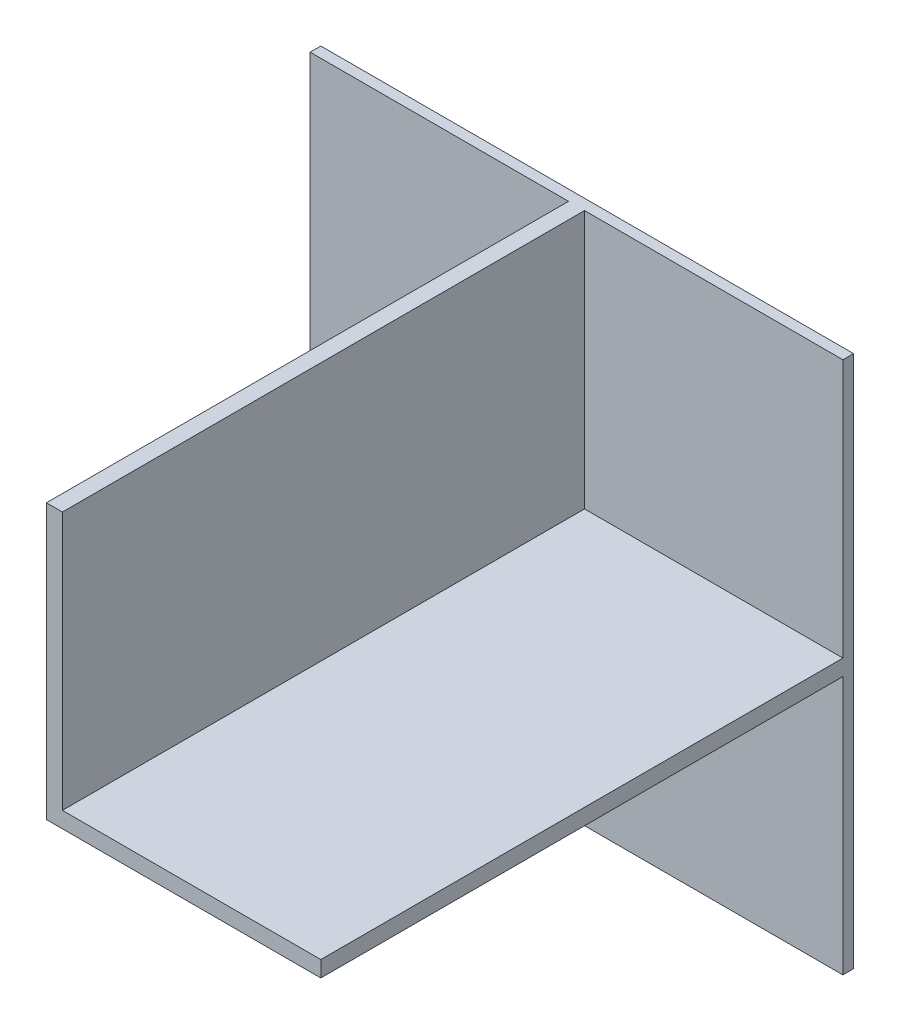
ISO-10303-21;
HEADER;
FILE_DESCRIPTION(('STEP AP214'),'2;1');
FILE_NAME('part.step','',(''),(''),'','','');
FILE_SCHEMA(('AUTOMOTIVE_DESIGN { 1 0 10303 214 1 1 1 1 }'));
ENDSEC;
DATA;
#1=APPLICATION_CONTEXT('core data for automotive mechanical design processes');
#2=APPLICATION_PROTOCOL_DEFINITION('international standard','automotive_design',2000,#1);
#3=PRODUCT_CONTEXT('',#1,'mechanical');
#4=PRODUCT('Part','Part','',(#3));
#5=PRODUCT_RELATED_PRODUCT_CATEGORY('part','',(#4));
#6=PRODUCT_DEFINITION_FORMATION('','',#4);
#7=PRODUCT_DEFINITION_CONTEXT('part definition',#1,'design');
#8=PRODUCT_DEFINITION('design','',#6,#7);
#9=PRODUCT_DEFINITION_SHAPE('','',#8);
#10=(LENGTH_UNIT() NAMED_UNIT(*) SI_UNIT(.MILLI.,.METRE.));
#11=(NAMED_UNIT(*) PLANE_ANGLE_UNIT() SI_UNIT($,.RADIAN.));
#12=(NAMED_UNIT(*) SI_UNIT($,.STERADIAN.) SOLID_ANGLE_UNIT());
#13=UNCERTAINTY_MEASURE_WITH_UNIT(LENGTH_MEASURE(1.E-05),#10,'distance_accuracy_value','');
#14=(GEOMETRIC_REPRESENTATION_CONTEXT(3) GLOBAL_UNCERTAINTY_ASSIGNED_CONTEXT((#13)) GLOBAL_UNIT_ASSIGNED_CONTEXT((#10,
#11,#12)) REPRESENTATION_CONTEXT('',''));
#15=CARTESIAN_POINT('',(0.,0.,0.));
#16=DIRECTION('',(0.,0.,1.));
#17=DIRECTION('',(1.,0.,0.));
#18=AXIS2_PLACEMENT_3D('',#15,#16,#17);
#19=CARTESIAN_POINT('',(0.,0.,4.));
#20=DIRECTION('',(0.,0.,1.));
#21=DIRECTION('',(1.,0.,0.));
#22=AXIS2_PLACEMENT_3D('',#19,#20,#21);
#23=PLANE('',#22);
#24=DIRECTION('',(-1.,0.,0.));
#25=VECTOR('',#24,1.);
#26=CARTESIAN_POINT('',(0.,-3.,4.));
#27=LINE('',#26,#25);
#28=CARTESIAN_POINT('',(100.,-3.,4.));
#29=VERTEX_POINT('',#28);
#30=CARTESIAN_POINT('',(-3.,-3.,4.));
#31=VERTEX_POINT('',#30);
#32=EDGE_CURVE('E168',#29,#31,#27,.T.);
#33=ORIENTED_EDGE('',*,*,#32,.T.);
#34=DIRECTION('',(0.,1.,0.));
#35=VECTOR('',#34,1.);
#36=CARTESIAN_POINT('',(-3.,0.,4.));
#37=LINE('',#36,#35);
#38=CARTESIAN_POINT('',(-3.,100.,4.));
#39=VERTEX_POINT('',#38);
#40=EDGE_CURVE('E57',#31,#39,#37,.T.);
#41=ORIENTED_EDGE('',*,*,#40,.T.);
#42=DIRECTION('',(-1.,0.,0.));
#43=VECTOR('',#42,1.);
#44=CARTESIAN_POINT('',(0.,100.,4.));
#45=LINE('',#44,#43);
#46=CARTESIAN_POINT('',(-100.,100.,4.));
#47=VERTEX_POINT('',#46);
#48=EDGE_CURVE('E199',#39,#47,#45,.T.);
#49=ORIENTED_EDGE('',*,*,#48,.T.);
#50=DIRECTION('',(0.,-1.,0.));
#51=VECTOR('',#50,1.);
#52=CARTESIAN_POINT('',(-100.,0.,4.));
#53=LINE('',#52,#51);
#54=CARTESIAN_POINT('',(-100.,-100.,4.));
#55=VERTEX_POINT('',#54);
#56=EDGE_CURVE('E66',#47,#55,#53,.T.);
#57=ORIENTED_EDGE('',*,*,#56,.T.);
#58=DIRECTION('',(-1.,0.,0.));
#59=VECTOR('',#58,1.);
#60=CARTESIAN_POINT('',(0.,-100.,4.));
#61=LINE('',#60,#59);
#62=CARTESIAN_POINT('',(100.,-100.,4.));
#63=VERTEX_POINT('',#62);
#64=EDGE_CURVE('E191',#63,#55,#61,.T.);
#65=ORIENTED_EDGE('',*,*,#64,.F.);
#66=DIRECTION('',(0.,-1.,0.));
#67=VECTOR('',#66,1.);
#68=CARTESIAN_POINT('',(100.,0.,4.));
#69=LINE('',#68,#67);
#70=EDGE_CURVE('E93',#29,#63,#69,.T.);
#71=ORIENTED_EDGE('',*,*,#70,.F.);
#72=EDGE_LOOP('',(#33,#41,#49,#57,#65,#71));
#73=FACE_BOUND('',#72,.T.);
#74=ADVANCED_FACE('F41',(#73),#23,.T.);
#75=CARTESIAN_POINT('',(0.,-100.,4.));
#76=DIRECTION('',(0.,-1.,0.));
#77=DIRECTION('',(0.,0.,-1.));
#78=AXIS2_PLACEMENT_3D('',#75,#76,#77);
#79=PLANE('',#78);
#80=DIRECTION('',(-1.,0.,0.));
#81=VECTOR('',#80,1.);
#82=CARTESIAN_POINT('',(0.,-100.,0.));
#83=LINE('',#82,#81);
#84=CARTESIAN_POINT('',(100.,-100.,0.));
#85=VERTEX_POINT('',#84);
#86=CARTESIAN_POINT('',(-100.,-100.,0.));
#87=VERTEX_POINT('',#86);
#88=EDGE_CURVE('E135',#85,#87,#83,.T.);
#89=ORIENTED_EDGE('',*,*,#88,.F.);
#90=DIRECTION('',(0.,0.,-1.));
#91=VECTOR('',#90,1.);
#92=CARTESIAN_POINT('',(100.,-100.,4.));
#93=LINE('',#92,#91);
#94=EDGE_CURVE('E11',#63,#85,#93,.T.);
#95=ORIENTED_EDGE('',*,*,#94,.F.);
#96=ORIENTED_EDGE('',*,*,#64,.T.);
#97=DIRECTION('',(0.,0.,-1.));
#98=VECTOR('',#97,1.);
#99=CARTESIAN_POINT('',(-100.,-100.,4.));
#100=LINE('',#99,#98);
#101=EDGE_CURVE('E86',#55,#87,#100,.T.);
#102=ORIENTED_EDGE('',*,*,#101,.T.);
#103=EDGE_LOOP('',(#89,#95,#96,#102));
#104=FACE_BOUND('',#103,.T.);
#105=ADVANCED_FACE('F43',(#104),#79,.T.);
#106=CARTESIAN_POINT('',(100.,0.,4.));
#107=DIRECTION('',(1.,0.,0.));
#108=DIRECTION('',(0.,0.,-1.));
#109=AXIS2_PLACEMENT_3D('',#106,#107,#108);
#110=PLANE('',#109);
#111=DIRECTION('',(0.,-1.,0.));
#112=VECTOR('',#111,1.);
#113=CARTESIAN_POINT('',(100.,0.,0.));
#114=LINE('',#113,#112);
#115=CARTESIAN_POINT('',(100.,100.,0.));
#116=VERTEX_POINT('',#115);
#117=EDGE_CURVE('E209',#116,#85,#114,.T.);
#118=ORIENTED_EDGE('',*,*,#117,.F.);
#119=DIRECTION('',(0.,0.,-1.));
#120=VECTOR('',#119,1.);
#121=CARTESIAN_POINT('',(100.,100.,4.));
#122=LINE('',#121,#120);
#123=CARTESIAN_POINT('',(100.,100.,4.));
#124=VERTEX_POINT('',#123);
#125=EDGE_CURVE('E50',#124,#116,#122,.T.);
#126=ORIENTED_EDGE('',*,*,#125,.F.);
#127=CARTESIAN_POINT('',(100.,3.,4.));
#128=VERTEX_POINT('',#127);
#129=EDGE_CURVE('E195',#124,#128,#69,.T.);
#130=ORIENTED_EDGE('',*,*,#129,.T.);
#131=DIRECTION('',(0.,0.,-1.));
#132=VECTOR('',#131,1.);
#133=CARTESIAN_POINT('',(100.,3.,200.));
#134=LINE('',#133,#132);
#135=CARTESIAN_POINT('',(100.,3.,200.));
#136=VERTEX_POINT('',#135);
#137=EDGE_CURVE('E186',#136,#128,#134,.T.);
#138=ORIENTED_EDGE('',*,*,#137,.F.);
#139=DIRECTION('',(0.,1.,0.));
#140=VECTOR('',#139,1.);
#141=CARTESIAN_POINT('',(100.,0.,200.));
#142=LINE('',#141,#140);
#143=CARTESIAN_POINT('',(100.,-3.,200.));
#144=VERTEX_POINT('',#143);
#145=EDGE_CURVE('E151',#144,#136,#142,.T.);
#146=ORIENTED_EDGE('',*,*,#145,.F.);
#147=DIRECTION('',(0.,0.,-1.));
#148=VECTOR('',#147,1.);
#149=CARTESIAN_POINT('',(100.,-3.,200.));
#150=LINE('',#149,#148);
#151=EDGE_CURVE('E136',#144,#29,#150,.T.);
#152=ORIENTED_EDGE('',*,*,#151,.T.);
#153=ORIENTED_EDGE('',*,*,#70,.T.);
#154=ORIENTED_EDGE('',*,*,#94,.T.);
#155=EDGE_LOOP('',(#118,#126,#130,#138,#146,#152,#153,#154));
#156=FACE_BOUND('',#155,.T.);
#157=ADVANCED_FACE('F234',(#156),#110,.T.);
#158=CARTESIAN_POINT('',(0.,100.,4.));
#159=DIRECTION('',(0.,-1.,0.));
#160=DIRECTION('',(0.,0.,-1.));
#161=AXIS2_PLACEMENT_3D('',#158,#159,#160);
#162=PLANE('',#161);
#163=DIRECTION('',(-1.,0.,0.));
#164=VECTOR('',#163,1.);
#165=CARTESIAN_POINT('',(0.,100.,0.));
#166=LINE('',#165,#164);
#167=CARTESIAN_POINT('',(-100.,100.,0.));
#168=VERTEX_POINT('',#167);
#169=EDGE_CURVE('E213',#116,#168,#166,.T.);
#170=ORIENTED_EDGE('',*,*,#169,.T.);
#171=DIRECTION('',(0.,0.,-1.));
#172=VECTOR('',#171,1.);
#173=CARTESIAN_POINT('',(-100.,100.,4.));
#174=LINE('',#173,#172);
#175=EDGE_CURVE('E220',#47,#168,#174,.T.);
#176=ORIENTED_EDGE('',*,*,#175,.F.);
#177=ORIENTED_EDGE('',*,*,#48,.F.);
#178=DIRECTION('',(0.,0.,-1.));
#179=VECTOR('',#178,1.);
#180=CARTESIAN_POINT('',(-3.,100.,200.));
#181=LINE('',#180,#179);
#182=CARTESIAN_POINT('',(-3.,100.,200.));
#183=VERTEX_POINT('',#182);
#184=EDGE_CURVE('E165',#183,#39,#181,.T.);
#185=ORIENTED_EDGE('',*,*,#184,.F.);
#186=DIRECTION('',(-1.,0.,0.));
#187=VECTOR('',#186,1.);
#188=CARTESIAN_POINT('',(0.,100.,200.));
#189=LINE('',#188,#187);
#190=CARTESIAN_POINT('',(3.,100.,200.));
#191=VERTEX_POINT('',#190);
#192=EDGE_CURVE('E143',#191,#183,#189,.T.);
#193=ORIENTED_EDGE('',*,*,#192,.F.);
#194=DIRECTION('',(0.,0.,-1.));
#195=VECTOR('',#194,1.);
#196=CARTESIAN_POINT('',(3.,100.,200.));
#197=LINE('',#196,#195);
#198=CARTESIAN_POINT('',(3.,100.,4.));
#199=VERTEX_POINT('',#198);
#200=EDGE_CURVE('E179',#191,#199,#197,.T.);
#201=ORIENTED_EDGE('',*,*,#200,.T.);
#202=EDGE_CURVE('E200',#124,#199,#45,.T.);
#203=ORIENTED_EDGE('',*,*,#202,.F.);
#204=ORIENTED_EDGE('',*,*,#125,.T.);
#205=EDGE_LOOP('',(#170,#176,#177,#185,#193,#201,#203,#204));
#206=FACE_BOUND('',#205,.T.);
#207=ADVANCED_FACE('F227',(#206),#162,.F.);
#208=CARTESIAN_POINT('',(-100.,0.,4.));
#209=DIRECTION('',(1.,0.,0.));
#210=DIRECTION('',(0.,0.,-1.));
#211=AXIS2_PLACEMENT_3D('',#208,#209,#210);
#212=PLANE('',#211);
#213=DIRECTION('',(0.,-1.,0.));
#214=VECTOR('',#213,1.);
#215=CARTESIAN_POINT('',(-100.,0.,0.));
#216=LINE('',#215,#214);
#217=EDGE_CURVE('E194',#168,#87,#216,.T.);
#218=ORIENTED_EDGE('',*,*,#217,.T.);
#219=ORIENTED_EDGE('',*,*,#101,.F.);
#220=ORIENTED_EDGE('',*,*,#56,.F.);
#221=ORIENTED_EDGE('',*,*,#175,.T.);
#222=EDGE_LOOP('',(#218,#219,#220,#221));
#223=FACE_BOUND('',#222,.T.);
#224=ADVANCED_FACE('F247',(#223),#212,.F.);
#225=DIRECTION('',(0.,1.,0.));
#226=VECTOR('',#225,1.);
#227=CARTESIAN_POINT('',(3.,0.,4.));
#228=LINE('',#227,#226);
#229=CARTESIAN_POINT('',(3.,3.,4.));
#230=VERTEX_POINT('',#229);
#231=EDGE_CURVE('E146',#230,#199,#228,.T.);
#232=ORIENTED_EDGE('',*,*,#231,.F.);
#233=DIRECTION('',(1.,0.,0.));
#234=VECTOR('',#233,1.);
#235=CARTESIAN_POINT('',(0.,3.,4.));
#236=LINE('',#235,#234);
#237=EDGE_CURVE('E171',#230,#128,#236,.T.);
#238=ORIENTED_EDGE('',*,*,#237,.T.);
#239=ORIENTED_EDGE('',*,*,#129,.F.);
#240=ORIENTED_EDGE('',*,*,#202,.T.);
#241=EDGE_LOOP('',(#232,#238,#239,#240));
#242=FACE_BOUND('',#241,.T.);
#243=ADVANCED_FACE('F241',(#242),#23,.T.);
#244=CARTESIAN_POINT('',(0.,0.,0.));
#245=DIRECTION('',(0.,0.,1.));
#246=DIRECTION('',(1.,0.,0.));
#247=AXIS2_PLACEMENT_3D('',#244,#245,#246);
#248=PLANE('',#247);
#249=ORIENTED_EDGE('',*,*,#88,.T.);
#250=ORIENTED_EDGE('',*,*,#217,.F.);
#251=ORIENTED_EDGE('',*,*,#169,.F.);
#252=ORIENTED_EDGE('',*,*,#117,.T.);
#253=EDGE_LOOP('',(#249,#250,#251,#252));
#254=FACE_BOUND('',#253,.T.);
#255=ADVANCED_FACE('F233',(#254),#248,.F.);
#256=CARTESIAN_POINT('',(-3.,0.,200.));
#257=DIRECTION('',(-1.,0.,0.));
#258=DIRECTION('',(0.,-1.,0.));
#259=AXIS2_PLACEMENT_3D('',#256,#257,#258);
#260=PLANE('',#259);
#261=ORIENTED_EDGE('',*,*,#40,.F.);
#262=DIRECTION('',(0.,0.,-1.));
#263=VECTOR('',#262,1.);
#264=CARTESIAN_POINT('',(-3.,-3.,200.));
#265=LINE('',#264,#263);
#266=CARTESIAN_POINT('',(-3.,-3.,200.));
#267=VERTEX_POINT('',#266);
#268=EDGE_CURVE('E126',#267,#31,#265,.T.);
#269=ORIENTED_EDGE('',*,*,#268,.F.);
#270=DIRECTION('',(0.,1.,0.));
#271=VECTOR('',#270,1.);
#272=CARTESIAN_POINT('',(-3.,0.,200.));
#273=LINE('',#272,#271);
#274=EDGE_CURVE('E129',#267,#183,#273,.T.);
#275=ORIENTED_EDGE('',*,*,#274,.T.);
#276=ORIENTED_EDGE('',*,*,#184,.T.);
#277=EDGE_LOOP('',(#261,#269,#275,#276));
#278=FACE_BOUND('',#277,.T.);
#279=ADVANCED_FACE('F128',(#278),#260,.T.);
#280=CARTESIAN_POINT('',(0.,-3.,200.));
#281=DIRECTION('',(0.,-1.,0.));
#282=DIRECTION('',(1.,0.,0.));
#283=AXIS2_PLACEMENT_3D('',#280,#281,#282);
#284=PLANE('',#283);
#285=ORIENTED_EDGE('',*,*,#32,.F.);
#286=ORIENTED_EDGE('',*,*,#151,.F.);
#287=DIRECTION('',(-1.,0.,0.));
#288=VECTOR('',#287,1.);
#289=CARTESIAN_POINT('',(0.,-3.,200.));
#290=LINE('',#289,#288);
#291=EDGE_CURVE('E141',#144,#267,#290,.T.);
#292=ORIENTED_EDGE('',*,*,#291,.T.);
#293=ORIENTED_EDGE('',*,*,#268,.T.);
#294=EDGE_LOOP('',(#285,#286,#292,#293));
#295=FACE_BOUND('',#294,.T.);
#296=ADVANCED_FACE('F148',(#295),#284,.T.);
#297=CARTESIAN_POINT('',(0.,3.,200.));
#298=DIRECTION('',(0.,1.,0.));
#299=DIRECTION('',(-1.,0.,0.));
#300=AXIS2_PLACEMENT_3D('',#297,#298,#299);
#301=PLANE('',#300);
#302=ORIENTED_EDGE('',*,*,#237,.F.);
#303=DIRECTION('',(0.,0.,-1.));
#304=VECTOR('',#303,1.);
#305=CARTESIAN_POINT('',(3.,3.,200.));
#306=LINE('',#305,#304);
#307=CARTESIAN_POINT('',(3.,3.,200.));
#308=VERTEX_POINT('',#307);
#309=EDGE_CURVE('E183',#308,#230,#306,.T.);
#310=ORIENTED_EDGE('',*,*,#309,.F.);
#311=DIRECTION('',(1.,0.,0.));
#312=VECTOR('',#311,1.);
#313=CARTESIAN_POINT('',(0.,3.,200.));
#314=LINE('',#313,#312);
#315=EDGE_CURVE('E154',#308,#136,#314,.T.);
#316=ORIENTED_EDGE('',*,*,#315,.T.);
#317=ORIENTED_EDGE('',*,*,#137,.T.);
#318=EDGE_LOOP('',(#302,#310,#316,#317));
#319=FACE_BOUND('',#318,.T.);
#320=ADVANCED_FACE('F266',(#319),#301,.T.);
#321=CARTESIAN_POINT('',(3.,0.,200.));
#322=DIRECTION('',(-1.,0.,0.));
#323=DIRECTION('',(0.,-1.,0.));
#324=AXIS2_PLACEMENT_3D('',#321,#322,#323);
#325=PLANE('',#324);
#326=ORIENTED_EDGE('',*,*,#231,.T.);
#327=ORIENTED_EDGE('',*,*,#200,.F.);
#328=DIRECTION('',(0.,1.,0.));
#329=VECTOR('',#328,1.);
#330=CARTESIAN_POINT('',(3.,0.,200.));
#331=LINE('',#330,#329);
#332=EDGE_CURVE('E160',#308,#191,#331,.T.);
#333=ORIENTED_EDGE('',*,*,#332,.F.);
#334=ORIENTED_EDGE('',*,*,#309,.T.);
#335=EDGE_LOOP('',(#326,#327,#333,#334));
#336=FACE_BOUND('',#335,.T.);
#337=ADVANCED_FACE('F259',(#336),#325,.F.);
#338=CARTESIAN_POINT('',(0.,0.,200.));
#339=DIRECTION('',(0.,0.,1.));
#340=DIRECTION('',(1.,0.,0.));
#341=AXIS2_PLACEMENT_3D('',#338,#339,#340);
#342=PLANE('',#341);
#343=ORIENTED_EDGE('',*,*,#274,.F.);
#344=ORIENTED_EDGE('',*,*,#291,.F.);
#345=ORIENTED_EDGE('',*,*,#145,.T.);
#346=ORIENTED_EDGE('',*,*,#315,.F.);
#347=ORIENTED_EDGE('',*,*,#332,.T.);
#348=ORIENTED_EDGE('',*,*,#192,.T.);
#349=EDGE_LOOP('',(#343,#344,#345,#346,#347,#348));
#350=FACE_BOUND('',#349,.T.);
#351=ADVANCED_FACE('F140',(#350),#342,.T.);
#352=CLOSED_SHELL('',(#74,#105,#157,#207,#224,#243,#255,#279,#296,#320,#337,#351));
#353=MANIFOLD_SOLID_BREP('B2',#352);
#354=ADVANCED_BREP_SHAPE_REPRESENTATION('',(#18,#353),#14);
#355=SHAPE_DEFINITION_REPRESENTATION(#9,#354);
ENDSEC;
END-ISO-10303-21;
